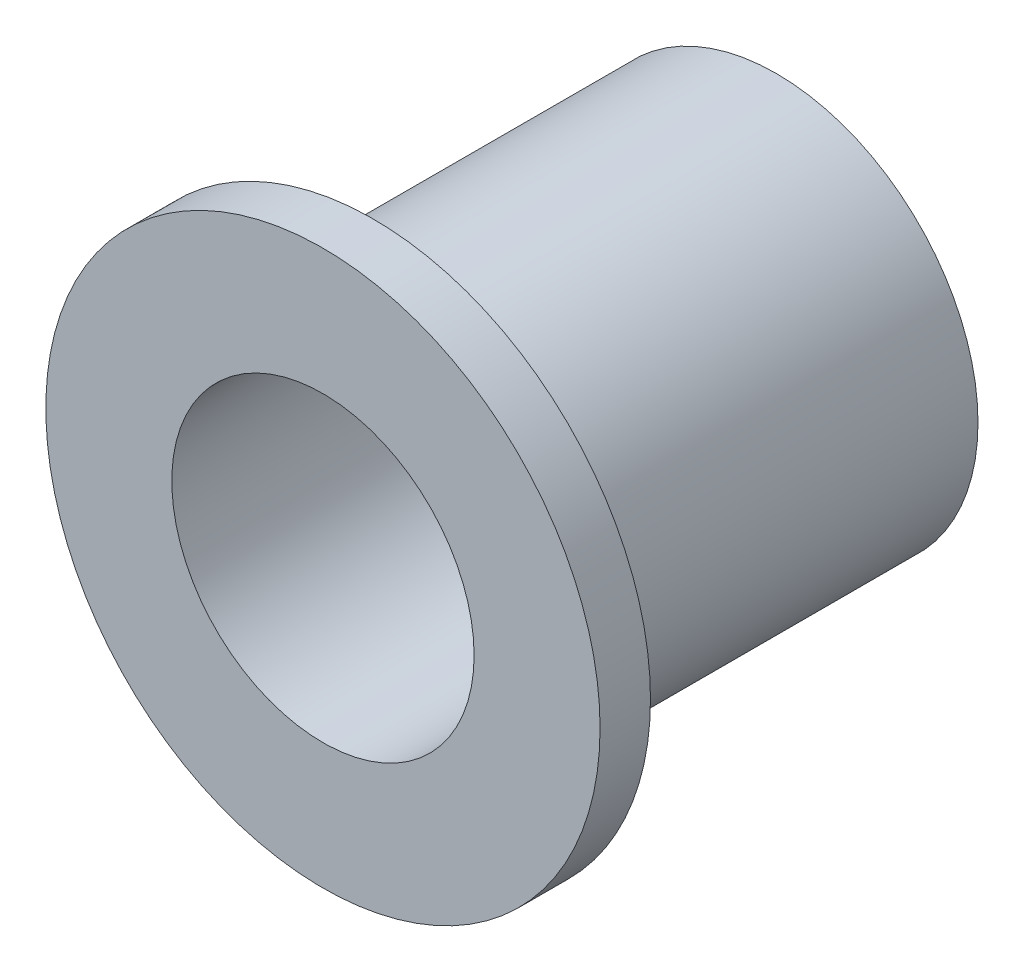
ISO-10303-21;
HEADER;
FILE_DESCRIPTION(('STEP AP214'),'2;1');
FILE_NAME('part.step','',(''),(''),'','','');
FILE_SCHEMA(('AUTOMOTIVE_DESIGN { 1 0 10303 214 1 1 1 1 }'));
ENDSEC;
DATA;
#1=APPLICATION_CONTEXT('core data for automotive mechanical design processes');
#2=APPLICATION_PROTOCOL_DEFINITION('international standard','automotive_design',2000,#1);
#3=PRODUCT_CONTEXT('',#1,'mechanical');
#4=PRODUCT('Part','Part','',(#3));
#5=PRODUCT_RELATED_PRODUCT_CATEGORY('part','',(#4));
#6=PRODUCT_DEFINITION_FORMATION('','',#4);
#7=PRODUCT_DEFINITION_CONTEXT('part definition',#1,'design');
#8=PRODUCT_DEFINITION('design','',#6,#7);
#9=PRODUCT_DEFINITION_SHAPE('','',#8);
#10=(LENGTH_UNIT() NAMED_UNIT(*) SI_UNIT(.MILLI.,.METRE.));
#11=(NAMED_UNIT(*) PLANE_ANGLE_UNIT() SI_UNIT($,.RADIAN.));
#12=(NAMED_UNIT(*) SI_UNIT($,.STERADIAN.) SOLID_ANGLE_UNIT());
#13=UNCERTAINTY_MEASURE_WITH_UNIT(LENGTH_MEASURE(1.E-05),#10,'distance_accuracy_value','');
#14=(GEOMETRIC_REPRESENTATION_CONTEXT(3) GLOBAL_UNCERTAINTY_ASSIGNED_CONTEXT((#13)) GLOBAL_UNIT_ASSIGNED_CONTEXT((#10,
#11,#12)) REPRESENTATION_CONTEXT('',''));
#15=CARTESIAN_POINT('',(0.,0.,0.));
#16=DIRECTION('',(0.,0.,1.));
#17=DIRECTION('',(1.,0.,0.));
#18=AXIS2_PLACEMENT_3D('',#15,#16,#17);
#19=CARTESIAN_POINT('',(0.,0.,0.));
#20=DIRECTION('',(0.,0.,1.));
#21=DIRECTION('',(1.,0.,0.));
#22=AXIS2_PLACEMENT_3D('',#19,#20,#21);
#23=PLANE('',#22);
#24=CARTESIAN_POINT('',(0.,0.,0.));
#25=DIRECTION('',(0.,0.,1.));
#26=DIRECTION('',(1.,0.,0.));
#27=AXIS2_PLACEMENT_3D('',#24,#25,#26);
#28=CIRCLE('',#27,8.73125);
#29=CARTESIAN_POINT('',(8.73125,0.,0.));
#30=VERTEX_POINT('',#29);
#31=EDGE_CURVE('E42',#30,#30,#28,.T.);
#32=ORIENTED_EDGE('',*,*,#31,.F.);
#33=EDGE_LOOP('',(#32));
#34=FACE_BOUND('',#33,.T.);
#35=CARTESIAN_POINT('',(0.,0.,0.));
#36=DIRECTION('',(0.,0.,1.));
#37=DIRECTION('',(1.,0.,0.));
#38=AXIS2_PLACEMENT_3D('',#35,#36,#37);
#39=CIRCLE('',#38,6.35);
#40=CARTESIAN_POINT('',(6.35,0.,0.));
#41=VERTEX_POINT('',#40);
#42=EDGE_CURVE('E10',#41,#41,#39,.F.);
#43=ORIENTED_EDGE('',*,*,#42,.F.);
#44=EDGE_LOOP('',(#43));
#45=FACE_BOUND('',#44,.T.);
#46=ADVANCED_FACE('F31',(#34,#45),#23,.F.);
#47=CARTESIAN_POINT('',(0.,0.,1.5875));
#48=DIRECTION('',(0.,0.,-1.));
#49=DIRECTION('',(-1.,0.,0.));
#50=AXIS2_PLACEMENT_3D('',#47,#48,#49);
#51=CYLINDRICAL_SURFACE('',#50,8.73125);
#52=CARTESIAN_POINT('',(0.,0.,1.5875));
#53=DIRECTION('',(0.,0.,1.));
#54=DIRECTION('',(1.,0.,0.));
#55=AXIS2_PLACEMENT_3D('',#52,#53,#54);
#56=CIRCLE('',#55,8.73125);
#57=CARTESIAN_POINT('',(8.73125,0.,1.5875));
#58=VERTEX_POINT('',#57);
#59=EDGE_CURVE('E38',#58,#58,#56,.T.);
#60=ORIENTED_EDGE('',*,*,#59,.F.);
#61=EDGE_LOOP('',(#60));
#62=FACE_BOUND('',#61,.T.);
#63=ORIENTED_EDGE('',*,*,#31,.T.);
#64=EDGE_LOOP('',(#63));
#65=FACE_BOUND('',#64,.T.);
#66=ADVANCED_FACE('F33',(#62,#65),#51,.T.);
#67=CARTESIAN_POINT('',(0.,0.,1.5875));
#68=DIRECTION('',(0.,0.,1.));
#69=DIRECTION('',(1.,0.,0.));
#70=AXIS2_PLACEMENT_3D('',#67,#68,#69);
#71=PLANE('',#70);
#72=CARTESIAN_POINT('',(0.,0.,1.5875));
#73=DIRECTION('',(0.,0.,1.));
#74=DIRECTION('',(1.,0.,0.));
#75=AXIS2_PLACEMENT_3D('',#72,#73,#74);
#76=CIRCLE('',#75,4.7625);
#77=CARTESIAN_POINT('',(4.7625,0.,1.5875));
#78=VERTEX_POINT('',#77);
#79=EDGE_CURVE('E52',#78,#78,#76,.T.);
#80=ORIENTED_EDGE('',*,*,#79,.F.);
#81=EDGE_LOOP('',(#80));
#82=FACE_BOUND('',#81,.T.);
#83=ORIENTED_EDGE('',*,*,#59,.T.);
#84=EDGE_LOOP('',(#83));
#85=FACE_BOUND('',#84,.T.);
#86=ADVANCED_FACE('F67',(#82,#85),#71,.T.);
#87=CARTESIAN_POINT('',(0.,0.,-12.7));
#88=DIRECTION('',(0.,0.,1.));
#89=DIRECTION('',(1.,0.,0.));
#90=AXIS2_PLACEMENT_3D('',#87,#88,#89);
#91=CYLINDRICAL_SURFACE('',#90,6.35);
#92=CARTESIAN_POINT('',(0.,0.,-12.7));
#93=DIRECTION('',(0.,0.,-1.));
#94=DIRECTION('',(-1.,0.,0.));
#95=AXIS2_PLACEMENT_3D('',#92,#93,#94);
#96=CIRCLE('',#95,6.35);
#97=CARTESIAN_POINT('',(-6.35,0.,-12.7));
#98=VERTEX_POINT('',#97);
#99=EDGE_CURVE('E47',#98,#98,#96,.T.);
#100=ORIENTED_EDGE('',*,*,#99,.F.);
#101=EDGE_LOOP('',(#100));
#102=FACE_BOUND('',#101,.T.);
#103=ORIENTED_EDGE('',*,*,#42,.T.);
#104=EDGE_LOOP('',(#103));
#105=FACE_BOUND('',#104,.T.);
#106=ADVANCED_FACE('F69',(#102,#105),#91,.T.);
#107=CARTESIAN_POINT('',(0.,0.,-12.7));
#108=DIRECTION('',(0.,0.,-1.));
#109=DIRECTION('',(-1.,0.,0.));
#110=AXIS2_PLACEMENT_3D('',#107,#108,#109);
#111=PLANE('',#110);
#112=CARTESIAN_POINT('',(0.,0.,-12.7));
#113=DIRECTION('',(0.,0.,1.));
#114=DIRECTION('',(1.,0.,0.));
#115=AXIS2_PLACEMENT_3D('',#112,#113,#114);
#116=CIRCLE('',#115,4.7625);
#117=CARTESIAN_POINT('',(4.7625,0.,-12.7));
#118=VERTEX_POINT('',#117);
#119=EDGE_CURVE('E51',#118,#118,#116,.T.);
#120=ORIENTED_EDGE('',*,*,#119,.T.);
#121=EDGE_LOOP('',(#120));
#122=FACE_BOUND('',#121,.T.);
#123=ORIENTED_EDGE('',*,*,#99,.T.);
#124=EDGE_LOOP('',(#123));
#125=FACE_BOUND('',#124,.T.);
#126=ADVANCED_FACE('F58',(#122,#125),#111,.T.);
#127=CARTESIAN_POINT('',(0.,0.,-12.7));
#128=DIRECTION('',(0.,0.,1.));
#129=DIRECTION('',(1.,0.,0.));
#130=AXIS2_PLACEMENT_3D('',#127,#128,#129);
#131=CYLINDRICAL_SURFACE('',#130,4.7625);
#132=ORIENTED_EDGE('',*,*,#119,.F.);
#133=EDGE_LOOP('',(#132));
#134=FACE_BOUND('',#133,.T.);
#135=ORIENTED_EDGE('',*,*,#79,.T.);
#136=EDGE_LOOP('',(#135));
#137=FACE_BOUND('',#136,.T.);
#138=ADVANCED_FACE('F61',(#134,#137),#131,.F.);
#139=CLOSED_SHELL('',(#46,#66,#86,#106,#126,#138));
#140=MANIFOLD_SOLID_BREP('B2',#139);
#141=ADVANCED_BREP_SHAPE_REPRESENTATION('',(#18,#140),#14);
#142=SHAPE_DEFINITION_REPRESENTATION(#9,#141);
ENDSEC;
END-ISO-10303-21;
